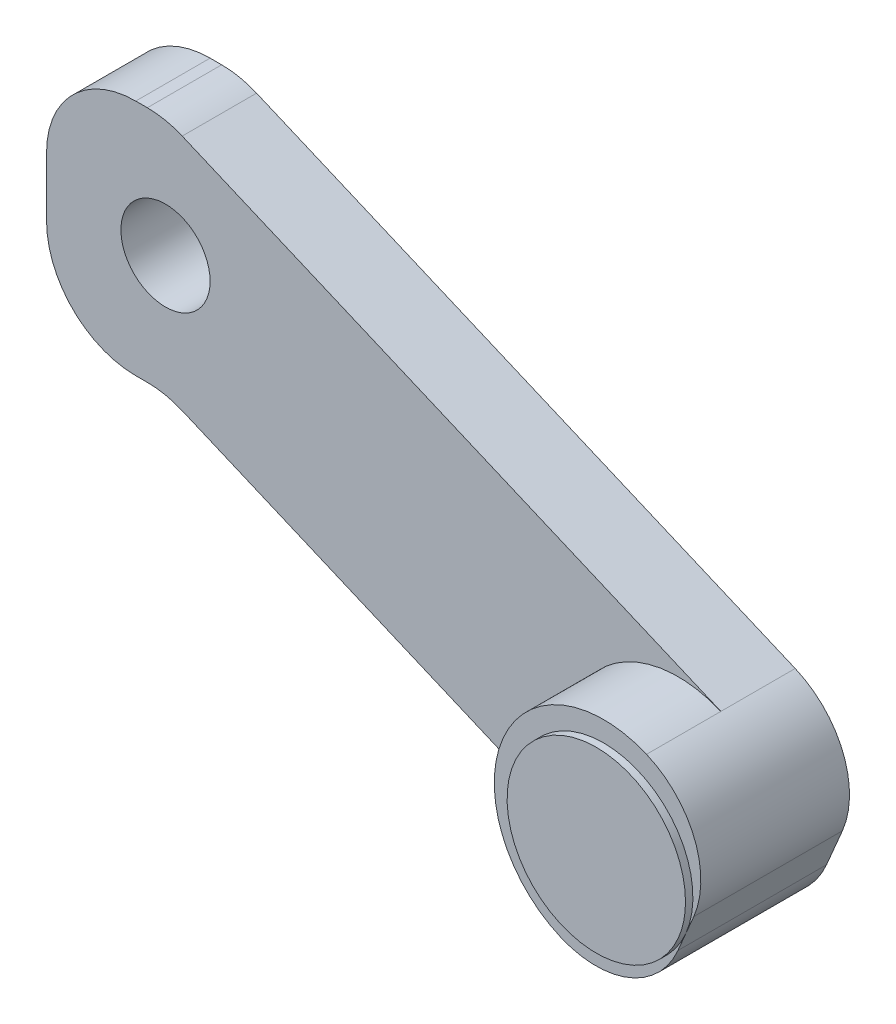
ISO-10303-21;
HEADER;
FILE_DESCRIPTION(('STEP AP214'),'2;1');
FILE_NAME('part.step','',(''),(''),'','','');
FILE_SCHEMA(('AUTOMOTIVE_DESIGN { 1 0 10303 214 1 1 1 1 }'));
ENDSEC;
DATA;
#1=APPLICATION_CONTEXT('core data for automotive mechanical design processes');
#2=APPLICATION_PROTOCOL_DEFINITION('international standard','automotive_design',2000,#1);
#3=PRODUCT_CONTEXT('',#1,'mechanical');
#4=PRODUCT('Part','Part','',(#3));
#5=PRODUCT_RELATED_PRODUCT_CATEGORY('part','',(#4));
#6=PRODUCT_DEFINITION_FORMATION('','',#4);
#7=PRODUCT_DEFINITION_CONTEXT('part definition',#1,'design');
#8=PRODUCT_DEFINITION('design','',#6,#7);
#9=PRODUCT_DEFINITION_SHAPE('','',#8);
#10=(LENGTH_UNIT() NAMED_UNIT(*) SI_UNIT(.MILLI.,.METRE.));
#11=(NAMED_UNIT(*) PLANE_ANGLE_UNIT() SI_UNIT($,.RADIAN.));
#12=(NAMED_UNIT(*) SI_UNIT($,.STERADIAN.) SOLID_ANGLE_UNIT());
#13=UNCERTAINTY_MEASURE_WITH_UNIT(LENGTH_MEASURE(1.E-05),#10,'distance_accuracy_value','');
#14=(GEOMETRIC_REPRESENTATION_CONTEXT(3) GLOBAL_UNCERTAINTY_ASSIGNED_CONTEXT((#13)) GLOBAL_UNIT_ASSIGNED_CONTEXT((#10,
#11,#12)) REPRESENTATION_CONTEXT('',''));
#15=CARTESIAN_POINT('',(0.,0.,0.));
#16=DIRECTION('',(0.,0.,1.));
#17=DIRECTION('',(1.,0.,0.));
#18=AXIS2_PLACEMENT_3D('',#15,#16,#17);
#19=CARTESIAN_POINT('',(0.,0.,5.));
#20=DIRECTION('',(0.,0.,-1.));
#21=DIRECTION('',(-1.,0.,0.));
#22=AXIS2_PLACEMENT_3D('',#19,#20,#21);
#23=PLANE('',#22);
#24=CARTESIAN_POINT('',(34.4780144892492,-14.6531561579309,5.));
#25=DIRECTION('',(0.,0.,1.));
#26=DIRECTION('',(1.,0.,0.));
#27=AXIS2_PLACEMENT_3D('',#24,#25,#26);
#28=CIRCLE('',#27,7.36264734766779);
#29=CARTESIAN_POINT('',(37.3578450874492,-7.87708416216594,5.));
#30=VERTEX_POINT('',#29);
#31=CARTESIAN_POINT('',(31.5981838910491,-21.4292281536958,5.));
#32=VERTEX_POINT('',#31);
#33=EDGE_CURVE('E176',#30,#32,#28,.T.);
#34=ORIENTED_EDGE('',*,*,#33,.F.);
#35=DIRECTION('',(0.920330918458474,-0.391140640344852,0.));
#36=VECTOR('',#35,1.);
#37=CARTESIAN_POINT('',(0.,8.,5.));
#38=LINE('',#37,#36);
#39=CARTESIAN_POINT('',(1.12473997470389,7.52198551075085,5.));
#40=VERTEX_POINT('',#39);
#41=EDGE_CURVE('E199',#40,#30,#38,.T.);
#42=ORIENTED_EDGE('',*,*,#41,.F.);
#43=CARTESIAN_POINT('',(-1.22210386736522,2.,5.));
#44=DIRECTION('',(0.,0.,-1.));
#45=DIRECTION('',(-1.,0.,0.));
#46=AXIS2_PLACEMENT_3D('',#43,#44,#45);
#47=CIRCLE('',#46,6.);
#48=CARTESIAN_POINT('',(-1.22210386736522,8.,5.));
#49=VERTEX_POINT('',#48);
#50=EDGE_CURVE('E68',#40,#49,#47,.F.);
#51=ORIENTED_EDGE('',*,*,#50,.T.);
#52=DIRECTION('',(1.,0.,0.));
#53=VECTOR('',#52,1.);
#54=CARTESIAN_POINT('',(-8.,8.,5.));
#55=LINE('',#54,#53);
#56=CARTESIAN_POINT('',(-2.,8.,5.));
#57=VERTEX_POINT('',#56);
#58=EDGE_CURVE('E196',#57,#49,#55,.T.);
#59=ORIENTED_EDGE('',*,*,#58,.F.);
#60=CARTESIAN_POINT('',(-2.,2.,5.));
#61=DIRECTION('',(0.,0.,-1.));
#62=DIRECTION('',(-1.,0.,0.));
#63=AXIS2_PLACEMENT_3D('',#60,#61,#62);
#64=CIRCLE('',#63,6.);
#65=CARTESIAN_POINT('',(-8.,2.,5.));
#66=VERTEX_POINT('',#65);
#67=EDGE_CURVE('E251',#57,#66,#64,.F.);
#68=ORIENTED_EDGE('',*,*,#67,.T.);
#69=DIRECTION('',(0.,1.,0.));
#70=VECTOR('',#69,1.);
#71=CARTESIAN_POINT('',(-8.,-8.,5.));
#72=LINE('',#71,#70);
#73=CARTESIAN_POINT('',(-8.,-2.,5.));
#74=VERTEX_POINT('',#73);
#75=EDGE_CURVE('E193',#74,#66,#72,.T.);
#76=ORIENTED_EDGE('',*,*,#75,.F.);
#77=CARTESIAN_POINT('',(-2.,-2.,5.));
#78=DIRECTION('',(0.,0.,-1.));
#79=DIRECTION('',(-1.,0.,0.));
#80=AXIS2_PLACEMENT_3D('',#77,#78,#79);
#81=CIRCLE('',#80,6.);
#82=CARTESIAN_POINT('',(-2.,-8.,5.));
#83=VERTEX_POINT('',#82);
#84=EDGE_CURVE('E253',#74,#83,#81,.F.);
#85=ORIENTED_EDGE('',*,*,#84,.T.);
#86=DIRECTION('',(-1.,0.,0.));
#87=VECTOR('',#86,1.);
#88=CARTESIAN_POINT('',(0.,-8.,5.));
#89=LINE('',#88,#87);
#90=CARTESIAN_POINT('',(-1.22210386736522,-8.,5.));
#91=VERTEX_POINT('',#90);
#92=EDGE_CURVE('E205',#91,#83,#89,.T.);
#93=ORIENTED_EDGE('',*,*,#92,.F.);
#94=CARTESIAN_POINT('',(-1.22210386736522,-14.,5.));
#95=DIRECTION('',(0.,0.,-1.));
#96=DIRECTION('',(-1.,0.,0.));
#97=AXIS2_PLACEMENT_3D('',#94,#95,#96);
#98=CIRCLE('',#97,6.);
#99=CARTESIAN_POINT('',(1.12473997470389,-8.47801448924915,5.));
#100=VERTEX_POINT('',#99);
#101=EDGE_CURVE('E12',#91,#100,#98,.T.);
#102=ORIENTED_EDGE('',*,*,#101,.T.);
#103=DIRECTION('',(-0.920330918458475,0.391140640344851,0.));
#104=VECTOR('',#103,1.);
#105=CARTESIAN_POINT('',(37.1201694017999,-23.7760719957649,5.));
#106=LINE('',#105,#104);
#107=EDGE_CURVE('E202',#32,#100,#106,.T.);
#108=ORIENTED_EDGE('',*,*,#107,.F.);
#109=EDGE_LOOP('',(#34,#42,#51,#59,#68,#76,#85,#93,#102,#108));
#110=FACE_BOUND('',#109,.T.);
#111=CARTESIAN_POINT('',(0.,0.,5.));
#112=DIRECTION('',(0.,0.,1.));
#113=DIRECTION('',(1.,0.,0.));
#114=AXIS2_PLACEMENT_3D('',#111,#112,#113);
#115=CIRCLE('',#114,3.);
#116=CARTESIAN_POINT('',(3.00000000000001,0.,5.));
#117=VERTEX_POINT('',#116);
#118=EDGE_CURVE('E187',#117,#117,#115,.T.);
#119=ORIENTED_EDGE('',*,*,#118,.F.);
#120=EDGE_LOOP('',(#119));
#121=FACE_BOUND('',#120,.T.);
#122=ADVANCED_FACE('F53',(#110,#121),#23,.F.);
#123=CARTESIAN_POINT('',(0.,0.,0.));
#124=DIRECTION('',(0.,0.,-1.));
#125=DIRECTION('',(-1.,0.,0.));
#126=AXIS2_PLACEMENT_3D('',#123,#124,#125);
#127=PLANE('',#126);
#128=DIRECTION('',(-1.,0.,0.));
#129=VECTOR('',#128,1.);
#130=CARTESIAN_POINT('',(0.,-8.,0.));
#131=LINE('',#130,#129);
#132=CARTESIAN_POINT('',(-1.22210386736522,-8.,0.));
#133=VERTEX_POINT('',#132);
#134=CARTESIAN_POINT('',(-2.,-8.,0.));
#135=VERTEX_POINT('',#134);
#136=EDGE_CURVE('E197',#133,#135,#131,.T.);
#137=ORIENTED_EDGE('',*,*,#136,.T.);
#138=CARTESIAN_POINT('',(-2.,-2.,0.));
#139=DIRECTION('',(0.,0.,-1.));
#140=DIRECTION('',(-1.,0.,0.));
#141=AXIS2_PLACEMENT_3D('',#138,#139,#140);
#142=CIRCLE('',#141,6.);
#143=CARTESIAN_POINT('',(-8.,-2.,0.));
#144=VERTEX_POINT('',#143);
#145=EDGE_CURVE('E243',#135,#144,#142,.T.);
#146=ORIENTED_EDGE('',*,*,#145,.T.);
#147=DIRECTION('',(0.,1.,0.));
#148=VECTOR('',#147,1.);
#149=CARTESIAN_POINT('',(-8.,-8.,0.));
#150=LINE('',#149,#148);
#151=CARTESIAN_POINT('',(-8.,2.,0.));
#152=VERTEX_POINT('',#151);
#153=EDGE_CURVE('E190',#144,#152,#150,.T.);
#154=ORIENTED_EDGE('',*,*,#153,.T.);
#155=CARTESIAN_POINT('',(-2.,2.,0.));
#156=DIRECTION('',(0.,0.,-1.));
#157=DIRECTION('',(-1.,0.,0.));
#158=AXIS2_PLACEMENT_3D('',#155,#156,#157);
#159=CIRCLE('',#158,6.);
#160=CARTESIAN_POINT('',(-2.,8.,0.));
#161=VERTEX_POINT('',#160);
#162=EDGE_CURVE('E241',#152,#161,#159,.T.);
#163=ORIENTED_EDGE('',*,*,#162,.T.);
#164=DIRECTION('',(1.,0.,0.));
#165=VECTOR('',#164,1.);
#166=CARTESIAN_POINT('',(-8.,8.,0.));
#167=LINE('',#166,#165);
#168=CARTESIAN_POINT('',(-1.22210386736522,8.,0.));
#169=VERTEX_POINT('',#168);
#170=EDGE_CURVE('E211',#161,#169,#167,.T.);
#171=ORIENTED_EDGE('',*,*,#170,.T.);
#172=CARTESIAN_POINT('',(-1.22210386736522,2.,0.));
#173=DIRECTION('',(0.,0.,-1.));
#174=DIRECTION('',(-1.,0.,0.));
#175=AXIS2_PLACEMENT_3D('',#172,#173,#174);
#176=CIRCLE('',#175,6.);
#177=CARTESIAN_POINT('',(1.12473997470389,7.52198551075085,0.));
#178=VERTEX_POINT('',#177);
#179=EDGE_CURVE('E239',#169,#178,#176,.T.);
#180=ORIENTED_EDGE('',*,*,#179,.T.);
#181=DIRECTION('',(0.920330918458474,-0.391140640344852,0.));
#182=VECTOR('',#181,1.);
#183=CARTESIAN_POINT('',(0.,8.,0.));
#184=LINE('',#183,#182);
#185=CARTESIAN_POINT('',(37.3578450874492,-7.87708416216594,0.));
#186=VERTEX_POINT('',#185);
#187=EDGE_CURVE('E214',#178,#186,#184,.T.);
#188=ORIENTED_EDGE('',*,*,#187,.T.);
#189=CARTESIAN_POINT('',(35.0110012453801,-13.3990696729168,0.));
#190=DIRECTION('',(0.,0.,-1.));
#191=DIRECTION('',(-1.,0.,0.));
#192=AXIS2_PLACEMENT_3D('',#189,#190,#191);
#193=CIRCLE('',#192,6.);
#194=CARTESIAN_POINT('',(40.532986756131,-15.7459135149859,0.));
#195=VERTEX_POINT('',#194);
#196=EDGE_CURVE('E237',#186,#195,#193,.T.);
#197=ORIENTED_EDGE('',*,*,#196,.T.);
#198=DIRECTION('',(-0.391140640344852,-0.920330918458475,0.));
#199=VECTOR('',#198,1.);
#200=CARTESIAN_POINT('',(42.8798305982001,-10.2239280042351,0.));
#201=LINE('',#200,#199);
#202=CARTESIAN_POINT('',(39.467013243869,-18.2540864850141,0.));
#203=VERTEX_POINT('',#202);
#204=EDGE_CURVE('E217',#195,#203,#201,.T.);
#205=ORIENTED_EDGE('',*,*,#204,.T.);
#206=CARTESIAN_POINT('',(33.9450277331182,-15.907242642945,0.));
#207=DIRECTION('',(0.,0.,-1.));
#208=DIRECTION('',(-1.,0.,0.));
#209=AXIS2_PLACEMENT_3D('',#206,#207,#208);
#210=CIRCLE('',#209,6.);
#211=CARTESIAN_POINT('',(31.5981838910491,-21.4292281536958,0.));
#212=VERTEX_POINT('',#211);
#213=EDGE_CURVE('E235',#203,#212,#210,.T.);
#214=ORIENTED_EDGE('',*,*,#213,.T.);
#215=DIRECTION('',(-0.920330918458475,0.391140640344851,0.));
#216=VECTOR('',#215,1.);
#217=CARTESIAN_POINT('',(37.1201694017999,-23.7760719957649,0.));
#218=LINE('',#217,#216);
#219=CARTESIAN_POINT('',(1.12473997470389,-8.47801448924915,0.));
#220=VERTEX_POINT('',#219);
#221=EDGE_CURVE('E220',#212,#220,#218,.T.);
#222=ORIENTED_EDGE('',*,*,#221,.T.);
#223=CARTESIAN_POINT('',(-1.22210386736522,-14.,0.));
#224=DIRECTION('',(0.,0.,-1.));
#225=DIRECTION('',(-1.,0.,0.));
#226=AXIS2_PLACEMENT_3D('',#223,#224,#225);
#227=CIRCLE('',#226,6.);
#228=EDGE_CURVE('E61',#220,#133,#227,.F.);
#229=ORIENTED_EDGE('',*,*,#228,.T.);
#230=EDGE_LOOP('',(#137,#146,#154,#163,#171,#180,#188,#197,#205,#214,#222,#229));
#231=FACE_BOUND('',#230,.T.);
#232=CARTESIAN_POINT('',(0.,0.,0.));
#233=DIRECTION('',(0.,0.,1.));
#234=DIRECTION('',(1.,0.,0.));
#235=AXIS2_PLACEMENT_3D('',#232,#233,#234);
#236=CIRCLE('',#235,3.);
#237=CARTESIAN_POINT('',(3.00000000000001,0.,0.));
#238=VERTEX_POINT('',#237);
#239=EDGE_CURVE('E186',#238,#238,#236,.T.);
#240=ORIENTED_EDGE('',*,*,#239,.T.);
#241=EDGE_LOOP('',(#240));
#242=FACE_BOUND('',#241,.T.);
#243=ADVANCED_FACE('F268',(#231,#242),#127,.T.);
#244=CARTESIAN_POINT('',(-8.,-8.,5.));
#245=DIRECTION('',(-1.,0.,0.));
#246=DIRECTION('',(0.,0.,1.));
#247=AXIS2_PLACEMENT_3D('',#244,#245,#246);
#248=PLANE('',#247);
#249=ORIENTED_EDGE('',*,*,#153,.F.);
#250=DIRECTION('',(0.,0.,-1.));
#251=VECTOR('',#250,1.);
#252=CARTESIAN_POINT('',(-8.,-2.,5.));
#253=LINE('',#252,#251);
#254=EDGE_CURVE('E248',#144,#74,#253,.F.);
#255=ORIENTED_EDGE('',*,*,#254,.T.);
#256=ORIENTED_EDGE('',*,*,#75,.T.);
#257=DIRECTION('',(0.,0.,-1.));
#258=VECTOR('',#257,1.);
#259=CARTESIAN_POINT('',(-8.,2.,5.));
#260=LINE('',#259,#258);
#261=EDGE_CURVE('E245',#66,#152,#260,.T.);
#262=ORIENTED_EDGE('',*,*,#261,.T.);
#263=EDGE_LOOP('',(#249,#255,#256,#262));
#264=FACE_BOUND('',#263,.T.);
#265=ADVANCED_FACE('F306',(#264),#248,.T.);
#266=CARTESIAN_POINT('',(0.,-8.,5.));
#267=DIRECTION('',(0.,-1.,0.));
#268=DIRECTION('',(0.,0.,-1.));
#269=AXIS2_PLACEMENT_3D('',#266,#267,#268);
#270=PLANE('',#269);
#271=ORIENTED_EDGE('',*,*,#136,.F.);
#272=DIRECTION('',(0.,0.,-1.));
#273=VECTOR('',#272,1.);
#274=CARTESIAN_POINT('',(-1.22210386736522,-8.,5.));
#275=LINE('',#274,#273);
#276=EDGE_CURVE('E233',#133,#91,#275,.F.);
#277=ORIENTED_EDGE('',*,*,#276,.T.);
#278=ORIENTED_EDGE('',*,*,#92,.T.);
#279=DIRECTION('',(0.,0.,-1.));
#280=VECTOR('',#279,1.);
#281=CARTESIAN_POINT('',(-2.,-8.,5.));
#282=LINE('',#281,#280);
#283=EDGE_CURVE('E230',#83,#135,#282,.T.);
#284=ORIENTED_EDGE('',*,*,#283,.T.);
#285=EDGE_LOOP('',(#271,#277,#278,#284));
#286=FACE_BOUND('',#285,.T.);
#287=ADVANCED_FACE('F275',(#286),#270,.T.);
#288=CARTESIAN_POINT('',(37.1201694017999,-23.7760719957649,5.));
#289=DIRECTION('',(-0.391140640344852,-0.920330918458475,0.));
#290=DIRECTION('',(0.920330918458475,-0.391140640344852,0.));
#291=AXIS2_PLACEMENT_3D('',#288,#289,#290);
#292=PLANE('',#291);
#293=ORIENTED_EDGE('',*,*,#107,.T.);
#294=DIRECTION('',(0.,0.,-1.));
#295=VECTOR('',#294,1.);
#296=CARTESIAN_POINT('',(1.12473997470389,-8.47801448924915,0.));
#297=LINE('',#296,#295);
#298=EDGE_CURVE('E227',#100,#220,#297,.T.);
#299=ORIENTED_EDGE('',*,*,#298,.T.);
#300=ORIENTED_EDGE('',*,*,#221,.F.);
#301=DIRECTION('',(0.,0.,-1.));
#302=VECTOR('',#301,1.);
#303=CARTESIAN_POINT('',(31.5981838910491,-21.4292281536958,5.));
#304=LINE('',#303,#302);
#305=EDGE_CURVE('E208',#212,#32,#304,.F.);
#306=ORIENTED_EDGE('',*,*,#305,.T.);
#307=EDGE_LOOP('',(#293,#299,#300,#306));
#308=FACE_BOUND('',#307,.T.);
#309=ADVANCED_FACE('F282',(#308),#292,.T.);
#310=CARTESIAN_POINT('',(42.8798305982001,-10.2239280042351,5.));
#311=DIRECTION('',(0.920330918458475,-0.391140640344852,0.));
#312=DIRECTION('',(0.391140640344852,0.920330918458475,0.));
#313=AXIS2_PLACEMENT_3D('',#310,#311,#312);
#314=PLANE('',#313);
#315=ORIENTED_EDGE('',*,*,#204,.F.);
#316=DIRECTION('',(0.,0.,-1.));
#317=VECTOR('',#316,1.);
#318=CARTESIAN_POINT('',(40.532986756131,-15.7459135149859,5.));
#319=LINE('',#318,#317);
#320=CARTESIAN_POINT('',(40.532986756131,-15.7459135149859,10.));
#321=VERTEX_POINT('',#320);
#322=EDGE_CURVE('E169',#195,#321,#319,.F.);
#323=ORIENTED_EDGE('',*,*,#322,.T.);
#324=DIRECTION('',(0.391140640344852,0.920330918458474,0.));
#325=VECTOR('',#324,1.);
#326=CARTESIAN_POINT('',(39.467013243869,-18.2540864850141,10.));
#327=LINE('',#326,#325);
#328=CARTESIAN_POINT('',(40.,-17.,10.));
#329=VERTEX_POINT('',#328);
#330=EDGE_CURVE('E163',#329,#321,#327,.T.);
#331=ORIENTED_EDGE('',*,*,#330,.F.);
#332=CARTESIAN_POINT('',(39.467013243869,-18.2540864850141,10.));
#333=VERTEX_POINT('',#332);
#334=EDGE_CURVE('E153',#333,#329,#327,.T.);
#335=ORIENTED_EDGE('',*,*,#334,.F.);
#336=DIRECTION('',(0.,0.,-1.));
#337=VECTOR('',#336,1.);
#338=CARTESIAN_POINT('',(39.467013243869,-18.2540864850141,5.));
#339=LINE('',#338,#337);
#340=EDGE_CURVE('E264',#333,#203,#339,.T.);
#341=ORIENTED_EDGE('',*,*,#340,.T.);
#342=EDGE_LOOP('',(#315,#323,#331,#335,#341));
#343=FACE_BOUND('',#342,.T.);
#344=ADVANCED_FACE('F167',(#343),#314,.T.);
#345=CARTESIAN_POINT('',(0.,8.,5.));
#346=DIRECTION('',(0.391140640344852,0.920330918458474,0.));
#347=DIRECTION('',(-0.920330918458474,0.391140640344852,0.));
#348=AXIS2_PLACEMENT_3D('',#345,#346,#347);
#349=PLANE('',#348);
#350=ORIENTED_EDGE('',*,*,#187,.F.);
#351=DIRECTION('',(0.,0.,-1.));
#352=VECTOR('',#351,1.);
#353=CARTESIAN_POINT('',(1.12473997470389,7.52198551075085,5.));
#354=LINE('',#353,#352);
#355=EDGE_CURVE('E262',#178,#40,#354,.F.);
#356=ORIENTED_EDGE('',*,*,#355,.T.);
#357=ORIENTED_EDGE('',*,*,#41,.T.);
#358=DIRECTION('',(0.,0.,-1.));
#359=VECTOR('',#358,1.);
#360=CARTESIAN_POINT('',(37.3578450874492,-7.87708416216594,5.));
#361=LINE('',#360,#359);
#362=EDGE_CURVE('E259',#30,#186,#361,.T.);
#363=ORIENTED_EDGE('',*,*,#362,.T.);
#364=EDGE_LOOP('',(#350,#356,#357,#363));
#365=FACE_BOUND('',#364,.T.);
#366=ADVANCED_FACE('F294',(#365),#349,.T.);
#367=CARTESIAN_POINT('',(-8.,8.,5.));
#368=DIRECTION('',(0.,1.,0.));
#369=DIRECTION('',(0.,0.,1.));
#370=AXIS2_PLACEMENT_3D('',#367,#368,#369);
#371=PLANE('',#370);
#372=ORIENTED_EDGE('',*,*,#170,.F.);
#373=DIRECTION('',(0.,0.,-1.));
#374=VECTOR('',#373,1.);
#375=CARTESIAN_POINT('',(-2.,8.,5.));
#376=LINE('',#375,#374);
#377=EDGE_CURVE('E75',#161,#57,#376,.F.);
#378=ORIENTED_EDGE('',*,*,#377,.T.);
#379=ORIENTED_EDGE('',*,*,#58,.T.);
#380=DIRECTION('',(0.,0.,-1.));
#381=VECTOR('',#380,1.);
#382=CARTESIAN_POINT('',(-1.22210386736522,8.,5.));
#383=LINE('',#382,#381);
#384=EDGE_CURVE('E255',#49,#169,#383,.T.);
#385=ORIENTED_EDGE('',*,*,#384,.T.);
#386=EDGE_LOOP('',(#372,#378,#379,#385));
#387=FACE_BOUND('',#386,.T.);
#388=ADVANCED_FACE('F299',(#387),#371,.T.);
#389=CARTESIAN_POINT('',(0.,0.,5.));
#390=DIRECTION('',(0.,0.,-1.));
#391=DIRECTION('',(-1.,0.,0.));
#392=AXIS2_PLACEMENT_3D('',#389,#390,#391);
#393=CYLINDRICAL_SURFACE('',#392,3.);
#394=ORIENTED_EDGE('',*,*,#118,.T.);
#395=EDGE_LOOP('',(#394));
#396=FACE_BOUND('',#395,.T.);
#397=ORIENTED_EDGE('',*,*,#239,.F.);
#398=EDGE_LOOP('',(#397));
#399=FACE_BOUND('',#398,.T.);
#400=ADVANCED_FACE('F319',(#396,#399),#393,.F.);
#401=CARTESIAN_POINT('',(-1.22210386736522,-14.,5.));
#402=DIRECTION('',(0.,0.,1.));
#403=DIRECTION('',(1.,0.,0.));
#404=AXIS2_PLACEMENT_3D('',#401,#402,#403);
#405=CYLINDRICAL_SURFACE('',#404,6.);
#406=ORIENTED_EDGE('',*,*,#101,.F.);
#407=ORIENTED_EDGE('',*,*,#276,.F.);
#408=ORIENTED_EDGE('',*,*,#228,.F.);
#409=ORIENTED_EDGE('',*,*,#298,.F.);
#410=EDGE_LOOP('',(#406,#407,#408,#409));
#411=FACE_BOUND('',#410,.T.);
#412=ADVANCED_FACE('F279',(#411),#405,.F.);
#413=CARTESIAN_POINT('',(-2.,-2.,5.));
#414=DIRECTION('',(0.,0.,-1.));
#415=DIRECTION('',(-1.,0.,0.));
#416=AXIS2_PLACEMENT_3D('',#413,#414,#415);
#417=CYLINDRICAL_SURFACE('',#416,6.);
#418=ORIENTED_EDGE('',*,*,#84,.F.);
#419=ORIENTED_EDGE('',*,*,#254,.F.);
#420=ORIENTED_EDGE('',*,*,#145,.F.);
#421=ORIENTED_EDGE('',*,*,#283,.F.);
#422=EDGE_LOOP('',(#418,#419,#420,#421));
#423=FACE_BOUND('',#422,.T.);
#424=ADVANCED_FACE('F311',(#423),#417,.T.);
#425=CARTESIAN_POINT('',(-2.,2.,5.));
#426=DIRECTION('',(0.,0.,-1.));
#427=DIRECTION('',(-1.,0.,0.));
#428=AXIS2_PLACEMENT_3D('',#425,#426,#427);
#429=CYLINDRICAL_SURFACE('',#428,6.);
#430=ORIENTED_EDGE('',*,*,#67,.F.);
#431=ORIENTED_EDGE('',*,*,#377,.F.);
#432=ORIENTED_EDGE('',*,*,#162,.F.);
#433=ORIENTED_EDGE('',*,*,#261,.F.);
#434=EDGE_LOOP('',(#430,#431,#432,#433));
#435=FACE_BOUND('',#434,.T.);
#436=ADVANCED_FACE('F304',(#435),#429,.T.);
#437=CARTESIAN_POINT('',(-1.22210386736522,2.,5.));
#438=DIRECTION('',(0.,0.,-1.));
#439=DIRECTION('',(-1.,0.,0.));
#440=AXIS2_PLACEMENT_3D('',#437,#438,#439);
#441=CYLINDRICAL_SURFACE('',#440,6.);
#442=ORIENTED_EDGE('',*,*,#50,.F.);
#443=ORIENTED_EDGE('',*,*,#355,.F.);
#444=ORIENTED_EDGE('',*,*,#179,.F.);
#445=ORIENTED_EDGE('',*,*,#384,.F.);
#446=EDGE_LOOP('',(#442,#443,#444,#445));
#447=FACE_BOUND('',#446,.T.);
#448=ADVANCED_FACE('F298',(#447),#441,.T.);
#449=CARTESIAN_POINT('',(35.0110012453801,-13.3990696729168,5.));
#450=DIRECTION('',(0.,0.,-1.));
#451=DIRECTION('',(-1.,0.,0.));
#452=AXIS2_PLACEMENT_3D('',#449,#450,#451);
#453=CYLINDRICAL_SURFACE('',#452,6.);
#454=ORIENTED_EDGE('',*,*,#362,.F.);
#455=DIRECTION('',(0.,0.,-1.));
#456=VECTOR('',#455,1.);
#457=CARTESIAN_POINT('',(37.3578450874492,-7.87708416216593,10.));
#458=LINE('',#457,#456);
#459=CARTESIAN_POINT('',(37.3578450874492,-7.87708416216593,10.));
#460=VERTEX_POINT('',#459);
#461=EDGE_CURVE('E183',#460,#30,#458,.T.);
#462=ORIENTED_EDGE('',*,*,#461,.F.);
#463=CARTESIAN_POINT('',(35.0110012453801,-13.3990696729168,10.));
#464=DIRECTION('',(0.,0.,1.));
#465=DIRECTION('',(1.,0.,0.));
#466=AXIS2_PLACEMENT_3D('',#463,#464,#465);
#467=CIRCLE('',#466,6.00000000000001);
#468=EDGE_CURVE('E179',#321,#460,#467,.T.);
#469=ORIENTED_EDGE('',*,*,#468,.F.);
#470=ORIENTED_EDGE('',*,*,#322,.F.);
#471=ORIENTED_EDGE('',*,*,#196,.F.);
#472=EDGE_LOOP('',(#454,#462,#469,#470,#471));
#473=FACE_BOUND('',#472,.T.);
#474=ADVANCED_FACE('F292',(#473),#453,.T.);
#475=CARTESIAN_POINT('',(33.9450277331182,-15.907242642945,5.));
#476=DIRECTION('',(0.,0.,-1.));
#477=DIRECTION('',(-1.,0.,0.));
#478=AXIS2_PLACEMENT_3D('',#475,#476,#477);
#479=CYLINDRICAL_SURFACE('',#478,6.);
#480=ORIENTED_EDGE('',*,*,#340,.F.);
#481=CARTESIAN_POINT('',(33.9450277331182,-15.907242642945,10.));
#482=DIRECTION('',(0.,0.,1.));
#483=DIRECTION('',(1.,0.,0.));
#484=AXIS2_PLACEMENT_3D('',#481,#482,#483);
#485=CIRCLE('',#484,6.);
#486=CARTESIAN_POINT('',(31.5981838910491,-21.4292281536958,10.));
#487=VERTEX_POINT('',#486);
#488=EDGE_CURVE('E159',#487,#333,#485,.T.);
#489=ORIENTED_EDGE('',*,*,#488,.F.);
#490=DIRECTION('',(0.,0.,-1.));
#491=VECTOR('',#490,1.);
#492=CARTESIAN_POINT('',(31.5981838910491,-21.4292281536958,10.));
#493=LINE('',#492,#491);
#494=EDGE_CURVE('E162',#487,#32,#493,.T.);
#495=ORIENTED_EDGE('',*,*,#494,.T.);
#496=ORIENTED_EDGE('',*,*,#305,.F.);
#497=ORIENTED_EDGE('',*,*,#213,.F.);
#498=EDGE_LOOP('',(#480,#489,#495,#496,#497));
#499=FACE_BOUND('',#498,.T.);
#500=ADVANCED_FACE('F55',(#499),#479,.T.);
#501=CARTESIAN_POINT('',(34.4780144892492,-14.6531561579309,10.));
#502=DIRECTION('',(0.,0.,-1.));
#503=DIRECTION('',(-1.,0.,0.));
#504=AXIS2_PLACEMENT_3D('',#501,#502,#503);
#505=CYLINDRICAL_SURFACE('',#504,7.36264734766779);
#506=ORIENTED_EDGE('',*,*,#33,.T.);
#507=ORIENTED_EDGE('',*,*,#494,.F.);
#508=CARTESIAN_POINT('',(34.4780144892492,-14.6531561579309,10.));
#509=DIRECTION('',(0.,0.,1.));
#510=DIRECTION('',(1.,0.,0.));
#511=AXIS2_PLACEMENT_3D('',#508,#509,#510);
#512=CIRCLE('',#511,7.3626473476678);
#513=EDGE_CURVE('E172',#460,#487,#512,.T.);
#514=ORIENTED_EDGE('',*,*,#513,.F.);
#515=ORIENTED_EDGE('',*,*,#461,.T.);
#516=EDGE_LOOP('',(#506,#507,#514,#515));
#517=FACE_BOUND('',#516,.T.);
#518=ADVANCED_FACE('F287',(#517),#505,.T.);
#519=CARTESIAN_POINT('',(35.0110012453801,-13.3990696729168,10.));
#520=DIRECTION('',(0.,0.,1.));
#521=DIRECTION('',(1.,0.,0.));
#522=AXIS2_PLACEMENT_3D('',#519,#520,#521);
#523=PLANE('',#522);
#524=ORIENTED_EDGE('',*,*,#334,.T.);
#525=CARTESIAN_POINT('',(34.4780144892492,-14.6531561579309,10.));
#526=DIRECTION('',(0.,0.,1.));
#527=DIRECTION('',(1.,0.,0.));
#528=AXIS2_PLACEMENT_3D('',#525,#526,#527);
#529=CIRCLE('',#528,6.);
#530=EDGE_CURVE('E157',#329,#329,#529,.T.);
#531=ORIENTED_EDGE('',*,*,#530,.F.);
#532=ORIENTED_EDGE('',*,*,#330,.T.);
#533=ORIENTED_EDGE('',*,*,#468,.T.);
#534=ORIENTED_EDGE('',*,*,#513,.T.);
#535=ORIENTED_EDGE('',*,*,#488,.T.);
#536=EDGE_LOOP('',(#524,#531,#532,#533,#534,#535));
#537=FACE_BOUND('',#536,.T.);
#538=ADVANCED_FACE('F155',(#537),#523,.T.);
#539=CARTESIAN_POINT('',(34.4780144892492,-14.6531561579309,10.5));
#540=DIRECTION('',(0.,0.,-1.));
#541=DIRECTION('',(-1.,0.,0.));
#542=AXIS2_PLACEMENT_3D('',#539,#540,#541);
#543=CYLINDRICAL_SURFACE('',#542,6.);
#544=CARTESIAN_POINT('',(34.4780144892492,-14.6531561579309,10.5));
#545=DIRECTION('',(0.,0.,1.));
#546=DIRECTION('',(1.,0.,0.));
#547=AXIS2_PLACEMENT_3D('',#544,#545,#546);
#548=CIRCLE('',#547,6.);
#549=CARTESIAN_POINT('',(40.4780144892492,-14.6531561579309,10.5));
#550=VERTEX_POINT('',#549);
#551=EDGE_CURVE('E180',#550,#550,#548,.T.);
#552=ORIENTED_EDGE('',*,*,#551,.F.);
#553=EDGE_LOOP('',(#552));
#554=FACE_BOUND('',#553,.T.);
#555=ORIENTED_EDGE('',*,*,#530,.T.);
#556=EDGE_LOOP('',(#555));
#557=FACE_BOUND('',#556,.T.);
#558=ADVANCED_FACE('F455',(#554,#557),#543,.T.);
#559=CARTESIAN_POINT('',(34.4780144892492,-14.6531561579309,10.5));
#560=DIRECTION('',(0.,0.,1.));
#561=DIRECTION('',(1.,0.,0.));
#562=AXIS2_PLACEMENT_3D('',#559,#560,#561);
#563=PLANE('',#562);
#564=ORIENTED_EDGE('',*,*,#551,.T.);
#565=EDGE_LOOP('',(#564));
#566=FACE_BOUND('',#565,.T.);
#567=ADVANCED_FACE('F463',(#566),#563,.T.);
#568=CLOSED_SHELL('',(#122,#243,#265,#287,#309,#344,#366,#388,#400,#412,#424,#436,#448,#474,
#500,#518,#538,#558,#567));
#569=MANIFOLD_SOLID_BREP('B2',#568);
#570=ADVANCED_BREP_SHAPE_REPRESENTATION('',(#18,#569),#14);
#571=SHAPE_DEFINITION_REPRESENTATION(#9,#570);
ENDSEC;
END-ISO-10303-21;
